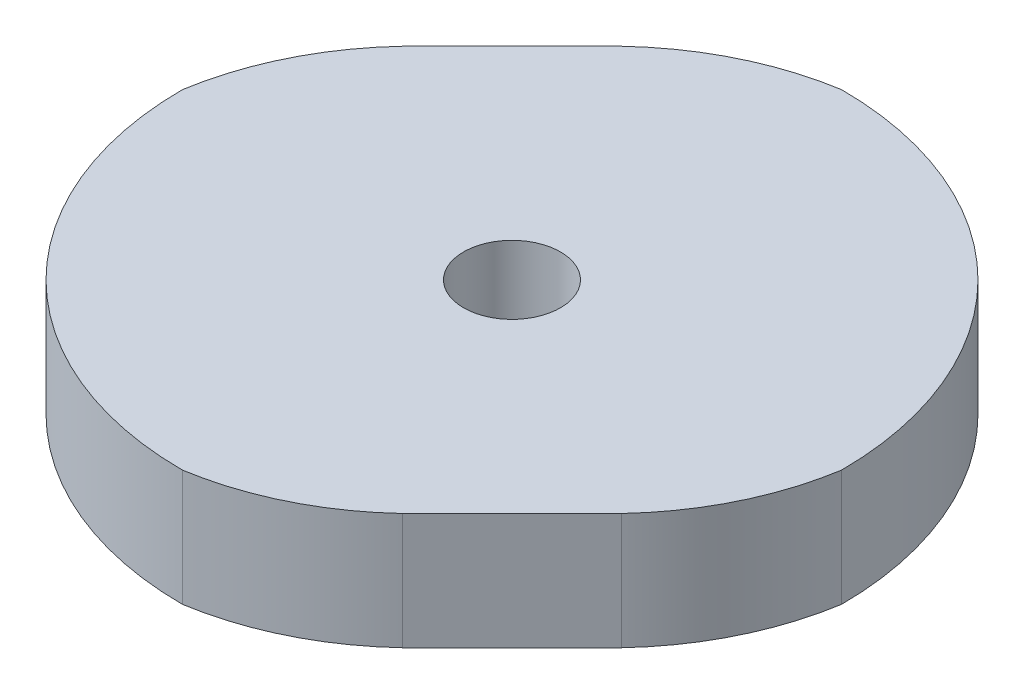
ISO-10303-21;
HEADER;
FILE_DESCRIPTION(('STEP AP214'),'2;1');
FILE_NAME('part.step','',(''),(''),'','','');
FILE_SCHEMA(('AUTOMOTIVE_DESIGN { 1 0 10303 214 1 1 1 1 }'));
ENDSEC;
DATA;
#1=APPLICATION_CONTEXT('core data for automotive mechanical design processes');
#2=APPLICATION_PROTOCOL_DEFINITION('international standard','automotive_design',2000,#1);
#3=PRODUCT_CONTEXT('',#1,'mechanical');
#4=PRODUCT('Part','Part','',(#3));
#5=PRODUCT_RELATED_PRODUCT_CATEGORY('part','',(#4));
#6=PRODUCT_DEFINITION_FORMATION('','',#4);
#7=PRODUCT_DEFINITION_CONTEXT('part definition',#1,'design');
#8=PRODUCT_DEFINITION('design','',#6,#7);
#9=PRODUCT_DEFINITION_SHAPE('','',#8);
#10=(LENGTH_UNIT() NAMED_UNIT(*) SI_UNIT(.MILLI.,.METRE.));
#11=(NAMED_UNIT(*) PLANE_ANGLE_UNIT() SI_UNIT($,.RADIAN.));
#12=(NAMED_UNIT(*) SI_UNIT($,.STERADIAN.) SOLID_ANGLE_UNIT());
#13=UNCERTAINTY_MEASURE_WITH_UNIT(LENGTH_MEASURE(1.E-05),#10,'distance_accuracy_value','');
#14=(GEOMETRIC_REPRESENTATION_CONTEXT(3) GLOBAL_UNCERTAINTY_ASSIGNED_CONTEXT((#13)) GLOBAL_UNIT_ASSIGNED_CONTEXT((#10,
#11,#12)) REPRESENTATION_CONTEXT('',''));
#15=CARTESIAN_POINT('',(0.,0.,0.));
#16=DIRECTION('',(0.,0.,1.));
#17=DIRECTION('',(1.,0.,0.));
#18=AXIS2_PLACEMENT_3D('',#15,#16,#17);
#19=CARTESIAN_POINT('',(-1.34728806771711,3.,1.14944795067981));
#20=DIRECTION('',(0.,-1.,0.));
#21=DIRECTION('',(0.,0.,-1.));
#22=AXIS2_PLACEMENT_3D('',#19,#20,#21);
#23=CYLINDRICAL_SURFACE('',#22,7.24448193990046);
#24=CARTESIAN_POINT('',(-1.34728806771711,0.,1.14944795067981));
#25=DIRECTION('',(0.,1.,0.));
#26=DIRECTION('',(0.,0.,1.));
#27=AXIS2_PLACEMENT_3D('',#24,#25,#26);
#28=CIRCLE('',#27,7.24448193990046);
#29=CARTESIAN_POINT('',(-8.49999999999999,0.,0.));
#30=VERTEX_POINT('',#29);
#31=CARTESIAN_POINT('',(-6.63227160484845,0.,-3.80549580175517));
#32=VERTEX_POINT('',#31);
#33=EDGE_CURVE('E148',#30,#32,#28,.F.);
#34=ORIENTED_EDGE('',*,*,#33,.F.);
#35=DIRECTION('',(0.,-1.,0.));
#36=VECTOR('',#35,1.);
#37=CARTESIAN_POINT('',(-8.49999999999999,3.,0.));
#38=LINE('',#37,#36);
#39=CARTESIAN_POINT('',(-8.49999999999999,3.,0.));
#40=VERTEX_POINT('',#39);
#41=EDGE_CURVE('E11',#40,#30,#38,.T.);
#42=ORIENTED_EDGE('',*,*,#41,.F.);
#43=CARTESIAN_POINT('',(-1.34728806771711,3.,1.14944795067981));
#44=DIRECTION('',(0.,1.,0.));
#45=DIRECTION('',(0.,0.,1.));
#46=AXIS2_PLACEMENT_3D('',#43,#44,#45);
#47=CIRCLE('',#46,7.24448193990046);
#48=CARTESIAN_POINT('',(-6.63227160484845,3.,-3.80549580175517));
#49=VERTEX_POINT('',#48);
#50=EDGE_CURVE('E206',#40,#49,#47,.F.);
#51=ORIENTED_EDGE('',*,*,#50,.T.);
#52=DIRECTION('',(0.,-1.,0.));
#53=VECTOR('',#52,1.);
#54=CARTESIAN_POINT('',(-6.63227160484845,3.,-3.80549580175517));
#55=LINE('',#54,#53);
#56=EDGE_CURVE('E83',#49,#32,#55,.T.);
#57=ORIENTED_EDGE('',*,*,#56,.T.);
#58=EDGE_LOOP('',(#34,#42,#51,#57));
#59=FACE_BOUND('',#58,.T.);
#60=ADVANCED_FACE('F32',(#59),#23,.T.);
#61=CARTESIAN_POINT('',(0.,3.,0.));
#62=DIRECTION('',(0.,-1.,0.));
#63=DIRECTION('',(0.,0.,-1.));
#64=AXIS2_PLACEMENT_3D('',#61,#62,#63);
#65=CYLINDRICAL_SURFACE('',#64,8.5);
#66=CARTESIAN_POINT('',(0.,0.,0.));
#67=DIRECTION('',(0.,1.,0.));
#68=DIRECTION('',(0.,0.,1.));
#69=AXIS2_PLACEMENT_3D('',#66,#67,#68);
#70=CIRCLE('',#69,8.5);
#71=CARTESIAN_POINT('',(0.,0.,8.5));
#72=VERTEX_POINT('',#71);
#73=EDGE_CURVE('E146',#30,#72,#70,.T.);
#74=ORIENTED_EDGE('',*,*,#73,.T.);
#75=DIRECTION('',(0.,-1.,0.));
#76=VECTOR('',#75,1.);
#77=CARTESIAN_POINT('',(0.,3.,8.5));
#78=LINE('',#77,#76);
#79=CARTESIAN_POINT('',(0.,3.,8.5));
#80=VERTEX_POINT('',#79);
#81=EDGE_CURVE('E41',#80,#72,#78,.T.);
#82=ORIENTED_EDGE('',*,*,#81,.F.);
#83=CARTESIAN_POINT('',(0.,3.,0.));
#84=DIRECTION('',(0.,1.,0.));
#85=DIRECTION('',(0.,0.,1.));
#86=AXIS2_PLACEMENT_3D('',#83,#84,#85);
#87=CIRCLE('',#86,8.5);
#88=EDGE_CURVE('E208',#40,#80,#87,.T.);
#89=ORIENTED_EDGE('',*,*,#88,.F.);
#90=ORIENTED_EDGE('',*,*,#41,.T.);
#91=EDGE_LOOP('',(#74,#82,#89,#90));
#92=FACE_BOUND('',#91,.T.);
#93=ADVANCED_FACE('F147',(#92),#65,.T.);
#94=CARTESIAN_POINT('',(-1.14944795067978,3.,1.34728806771712));
#95=DIRECTION('',(0.,-1.,0.));
#96=DIRECTION('',(0.,0.,-1.));
#97=AXIS2_PLACEMENT_3D('',#94,#95,#96);
#98=CYLINDRICAL_SURFACE('',#97,7.24448193990045);
#99=CARTESIAN_POINT('',(-1.14944795067978,0.,1.34728806771712));
#100=DIRECTION('',(0.,1.,0.));
#101=DIRECTION('',(0.,0.,1.));
#102=AXIS2_PLACEMENT_3D('',#99,#100,#101);
#103=CIRCLE('',#102,7.24448193990045);
#104=CARTESIAN_POINT('',(3.80549580175529,0.,6.63227160484838));
#105=VERTEX_POINT('',#104);
#106=EDGE_CURVE('E140',#72,#105,#103,.T.);
#107=ORIENTED_EDGE('',*,*,#106,.T.);
#108=DIRECTION('',(0.,-1.,0.));
#109=VECTOR('',#108,1.);
#110=CARTESIAN_POINT('',(3.80549580175529,3.,6.63227160484838));
#111=LINE('',#110,#109);
#112=CARTESIAN_POINT('',(3.80549580175529,3.,6.63227160484838));
#113=VERTEX_POINT('',#112);
#114=EDGE_CURVE('E132',#113,#105,#111,.T.);
#115=ORIENTED_EDGE('',*,*,#114,.F.);
#116=CARTESIAN_POINT('',(-1.14944795067978,3.,1.34728806771712));
#117=DIRECTION('',(0.,1.,0.));
#118=DIRECTION('',(0.,0.,1.));
#119=AXIS2_PLACEMENT_3D('',#116,#117,#118);
#120=CIRCLE('',#119,7.24448193990045);
#121=EDGE_CURVE('E142',#80,#113,#120,.T.);
#122=ORIENTED_EDGE('',*,*,#121,.F.);
#123=ORIENTED_EDGE('',*,*,#81,.T.);
#124=EDGE_LOOP('',(#107,#115,#122,#123));
#125=FACE_BOUND('',#124,.T.);
#126=ADVANCED_FACE('F138',(#125),#98,.T.);
#127=CARTESIAN_POINT('',(5.21888370330183,3.,5.21888370330185));
#128=DIRECTION('',(0.707106781186546,0.,0.707106781186548));
#129=DIRECTION('',(0.707106781186549,0.,-0.707106781186546));
#130=AXIS2_PLACEMENT_3D('',#127,#128,#129);
#131=PLANE('',#130);
#132=DIRECTION('',(-0.707106781186549,0.,0.707106781186546));
#133=VECTOR('',#132,1.);
#134=CARTESIAN_POINT('',(5.21888370330183,0.,5.21888370330185));
#135=LINE('',#134,#133);
#136=CARTESIAN_POINT('',(6.63227160484848,0.,3.8054958017552));
#137=VERTEX_POINT('',#136);
#138=EDGE_CURVE('E150',#137,#105,#135,.T.);
#139=ORIENTED_EDGE('',*,*,#138,.F.);
#140=DIRECTION('',(0.,-1.,0.));
#141=VECTOR('',#140,1.);
#142=CARTESIAN_POINT('',(6.63227160484848,3.,3.8054958017552));
#143=LINE('',#142,#141);
#144=CARTESIAN_POINT('',(6.63227160484848,3.,3.8054958017552));
#145=VERTEX_POINT('',#144);
#146=EDGE_CURVE('E126',#145,#137,#143,.T.);
#147=ORIENTED_EDGE('',*,*,#146,.F.);
#148=DIRECTION('',(-0.707106781186549,0.,0.707106781186546));
#149=VECTOR('',#148,1.);
#150=CARTESIAN_POINT('',(5.21888370330183,3.,5.21888370330185));
#151=LINE('',#150,#149);
#152=EDGE_CURVE('E213',#145,#113,#151,.T.);
#153=ORIENTED_EDGE('',*,*,#152,.T.);
#154=ORIENTED_EDGE('',*,*,#114,.T.);
#155=EDGE_LOOP('',(#139,#147,#153,#154));
#156=FACE_BOUND('',#155,.T.);
#157=ADVANCED_FACE('F189',(#156),#131,.T.);
#158=CARTESIAN_POINT('',(1.34728806771713,3.,-1.14944795067977));
#159=DIRECTION('',(0.,-1.,0.));
#160=DIRECTION('',(0.,0.,-1.));
#161=AXIS2_PLACEMENT_3D('',#158,#159,#160);
#162=CYLINDRICAL_SURFACE('',#161,7.24448193990044);
#163=CARTESIAN_POINT('',(1.34728806771713,0.,-1.14944795067977));
#164=DIRECTION('',(0.,1.,0.));
#165=DIRECTION('',(0.,0.,1.));
#166=AXIS2_PLACEMENT_3D('',#163,#164,#165);
#167=CIRCLE('',#166,7.24448193990044);
#168=CARTESIAN_POINT('',(8.5,0.,0.));
#169=VERTEX_POINT('',#168);
#170=EDGE_CURVE('E157',#169,#137,#167,.F.);
#171=ORIENTED_EDGE('',*,*,#170,.F.);
#172=DIRECTION('',(0.,-1.,0.));
#173=VECTOR('',#172,1.);
#174=CARTESIAN_POINT('',(8.5,3.,0.));
#175=LINE('',#174,#173);
#176=CARTESIAN_POINT('',(8.5,3.,0.));
#177=VERTEX_POINT('',#176);
#178=EDGE_CURVE('E124',#177,#169,#175,.T.);
#179=ORIENTED_EDGE('',*,*,#178,.F.);
#180=CARTESIAN_POINT('',(1.34728806771713,3.,-1.14944795067977));
#181=DIRECTION('',(0.,1.,0.));
#182=DIRECTION('',(0.,0.,1.));
#183=AXIS2_PLACEMENT_3D('',#180,#181,#182);
#184=CIRCLE('',#183,7.24448193990044);
#185=EDGE_CURVE('E118',#177,#145,#184,.F.);
#186=ORIENTED_EDGE('',*,*,#185,.T.);
#187=ORIENTED_EDGE('',*,*,#146,.T.);
#188=EDGE_LOOP('',(#171,#179,#186,#187));
#189=FACE_BOUND('',#188,.T.);
#190=ADVANCED_FACE('F192',(#189),#162,.T.);
#191=CARTESIAN_POINT('',(0.,3.,0.));
#192=DIRECTION('',(0.,-1.,0.));
#193=DIRECTION('',(0.,0.,-1.));
#194=AXIS2_PLACEMENT_3D('',#191,#192,#193);
#195=CYLINDRICAL_SURFACE('',#194,8.5);
#196=CARTESIAN_POINT('',(0.,0.,0.));
#197=DIRECTION('',(0.,1.,0.));
#198=DIRECTION('',(0.,0.,1.));
#199=AXIS2_PLACEMENT_3D('',#196,#197,#198);
#200=CIRCLE('',#199,8.5);
#201=CARTESIAN_POINT('',(0.,0.,-8.5));
#202=VERTEX_POINT('',#201);
#203=EDGE_CURVE('E123',#169,#202,#200,.T.);
#204=ORIENTED_EDGE('',*,*,#203,.T.);
#205=DIRECTION('',(0.,-1.,0.));
#206=VECTOR('',#205,1.);
#207=CARTESIAN_POINT('',(0.,3.,-8.5));
#208=LINE('',#207,#206);
#209=CARTESIAN_POINT('',(0.,3.,-8.5));
#210=VERTEX_POINT('',#209);
#211=EDGE_CURVE('E108',#210,#202,#208,.T.);
#212=ORIENTED_EDGE('',*,*,#211,.F.);
#213=CARTESIAN_POINT('',(0.,3.,0.));
#214=DIRECTION('',(0.,1.,0.));
#215=DIRECTION('',(0.,0.,1.));
#216=AXIS2_PLACEMENT_3D('',#213,#214,#215);
#217=CIRCLE('',#216,8.5);
#218=EDGE_CURVE('E111',#177,#210,#217,.T.);
#219=ORIENTED_EDGE('',*,*,#218,.F.);
#220=ORIENTED_EDGE('',*,*,#178,.T.);
#221=EDGE_LOOP('',(#204,#212,#219,#220));
#222=FACE_BOUND('',#221,.T.);
#223=ADVANCED_FACE('F121',(#222),#195,.T.);
#224=CARTESIAN_POINT('',(1.14944795067975,3.,-1.34728806771715));
#225=DIRECTION('',(0.,-1.,0.));
#226=DIRECTION('',(0.,0.,-1.));
#227=AXIS2_PLACEMENT_3D('',#224,#225,#226);
#228=CYLINDRICAL_SURFACE('',#227,7.24448193990042);
#229=CARTESIAN_POINT('',(1.14944795067975,0.,-1.34728806771715));
#230=DIRECTION('',(0.,1.,0.));
#231=DIRECTION('',(0.,0.,1.));
#232=AXIS2_PLACEMENT_3D('',#229,#230,#231);
#233=CIRCLE('',#232,7.24448193990042);
#234=CARTESIAN_POINT('',(-3.80549580175521,0.,-6.63227160484848));
#235=VERTEX_POINT('',#234);
#236=EDGE_CURVE('E161',#202,#235,#233,.T.);
#237=ORIENTED_EDGE('',*,*,#236,.T.);
#238=DIRECTION('',(0.,-1.,0.));
#239=VECTOR('',#238,1.);
#240=CARTESIAN_POINT('',(-3.80549580175521,3.,-6.63227160484848));
#241=LINE('',#240,#239);
#242=CARTESIAN_POINT('',(-3.80549580175521,3.,-6.63227160484848));
#243=VERTEX_POINT('',#242);
#244=EDGE_CURVE('E110',#243,#235,#241,.T.);
#245=ORIENTED_EDGE('',*,*,#244,.F.);
#246=CARTESIAN_POINT('',(1.14944795067975,3.,-1.34728806771715));
#247=DIRECTION('',(0.,1.,0.));
#248=DIRECTION('',(0.,0.,1.));
#249=AXIS2_PLACEMENT_3D('',#246,#247,#248);
#250=CIRCLE('',#249,7.24448193990042);
#251=EDGE_CURVE('E103',#210,#243,#250,.T.);
#252=ORIENTED_EDGE('',*,*,#251,.F.);
#253=ORIENTED_EDGE('',*,*,#211,.T.);
#254=EDGE_LOOP('',(#237,#245,#252,#253));
#255=FACE_BOUND('',#254,.T.);
#256=ADVANCED_FACE('F106',(#255),#228,.T.);
#257=CARTESIAN_POINT('',(0.,3.,0.));
#258=DIRECTION('',(0.,-1.,0.));
#259=DIRECTION('',(0.,0.,-1.));
#260=AXIS2_PLACEMENT_3D('',#257,#258,#259);
#261=CYLINDRICAL_SURFACE('',#260,1.25);
#262=CARTESIAN_POINT('',(0.,3.,0.));
#263=DIRECTION('',(0.,1.,0.));
#264=DIRECTION('',(0.,0.,1.));
#265=AXIS2_PLACEMENT_3D('',#262,#263,#264);
#266=CIRCLE('',#265,1.25);
#267=CARTESIAN_POINT('',(0.,3.,1.25));
#268=VERTEX_POINT('',#267);
#269=EDGE_CURVE('E163',#268,#268,#266,.T.);
#270=ORIENTED_EDGE('',*,*,#269,.T.);
#271=EDGE_LOOP('',(#270));
#272=FACE_BOUND('',#271,.T.);
#273=CARTESIAN_POINT('',(0.,0.,0.));
#274=DIRECTION('',(0.,1.,0.));
#275=DIRECTION('',(0.,0.,1.));
#276=AXIS2_PLACEMENT_3D('',#273,#274,#275);
#277=CIRCLE('',#276,1.25);
#278=CARTESIAN_POINT('',(0.,0.,1.25));
#279=VERTEX_POINT('',#278);
#280=EDGE_CURVE('E152',#279,#279,#277,.T.);
#281=ORIENTED_EDGE('',*,*,#280,.F.);
#282=EDGE_LOOP('',(#281));
#283=FACE_BOUND('',#282,.T.);
#284=ADVANCED_FACE('F34',(#272,#283),#261,.F.);
#285=CARTESIAN_POINT('',(-5.21888370330189,3.,-5.21888370330177));
#286=DIRECTION('',(0.707106781186555,0.,0.70710678118654));
#287=DIRECTION('',(0.70710678118654,0.,-0.707106781186555));
#288=AXIS2_PLACEMENT_3D('',#285,#286,#287);
#289=PLANE('',#288);
#290=DIRECTION('',(-0.70710678118654,0.,0.707106781186555));
#291=VECTOR('',#290,1.);
#292=CARTESIAN_POINT('',(-5.21888370330189,0.,-5.21888370330177));
#293=LINE('',#292,#291);
#294=EDGE_CURVE('E76',#235,#32,#293,.T.);
#295=ORIENTED_EDGE('',*,*,#294,.T.);
#296=ORIENTED_EDGE('',*,*,#56,.F.);
#297=DIRECTION('',(-0.70710678118654,0.,0.707106781186555));
#298=VECTOR('',#297,1.);
#299=CARTESIAN_POINT('',(-5.21888370330189,3.,-5.21888370330177));
#300=LINE('',#299,#298);
#301=EDGE_CURVE('E49',#243,#49,#300,.T.);
#302=ORIENTED_EDGE('',*,*,#301,.F.);
#303=ORIENTED_EDGE('',*,*,#244,.T.);
#304=EDGE_LOOP('',(#295,#296,#302,#303));
#305=FACE_BOUND('',#304,.T.);
#306=ADVANCED_FACE('F171',(#305),#289,.F.);
#307=CARTESIAN_POINT('',(0.,3.,0.));
#308=DIRECTION('',(0.,1.,0.));
#309=DIRECTION('',(0.,0.,1.));
#310=AXIS2_PLACEMENT_3D('',#307,#308,#309);
#311=PLANE('',#310);
#312=ORIENTED_EDGE('',*,*,#269,.F.);
#313=EDGE_LOOP('',(#312));
#314=FACE_BOUND('',#313,.T.);
#315=ORIENTED_EDGE('',*,*,#50,.F.);
#316=ORIENTED_EDGE('',*,*,#88,.T.);
#317=ORIENTED_EDGE('',*,*,#121,.T.);
#318=ORIENTED_EDGE('',*,*,#152,.F.);
#319=ORIENTED_EDGE('',*,*,#185,.F.);
#320=ORIENTED_EDGE('',*,*,#218,.T.);
#321=ORIENTED_EDGE('',*,*,#251,.T.);
#322=ORIENTED_EDGE('',*,*,#301,.T.);
#323=EDGE_LOOP('',(#315,#316,#317,#318,#319,#320,#321,#322));
#324=FACE_BOUND('',#323,.T.);
#325=ADVANCED_FACE('F115',(#314,#324),#311,.T.);
#326=CARTESIAN_POINT('',(0.,0.,0.));
#327=DIRECTION('',(0.,1.,0.));
#328=DIRECTION('',(0.,0.,1.));
#329=AXIS2_PLACEMENT_3D('',#326,#327,#328);
#330=PLANE('',#329);
#331=ORIENTED_EDGE('',*,*,#280,.T.);
#332=EDGE_LOOP('',(#331));
#333=FACE_BOUND('',#332,.T.);
#334=ORIENTED_EDGE('',*,*,#33,.T.);
#335=ORIENTED_EDGE('',*,*,#294,.F.);
#336=ORIENTED_EDGE('',*,*,#236,.F.);
#337=ORIENTED_EDGE('',*,*,#203,.F.);
#338=ORIENTED_EDGE('',*,*,#170,.T.);
#339=ORIENTED_EDGE('',*,*,#138,.T.);
#340=ORIENTED_EDGE('',*,*,#106,.F.);
#341=ORIENTED_EDGE('',*,*,#73,.F.);
#342=EDGE_LOOP('',(#334,#335,#336,#337,#338,#339,#340,#341));
#343=FACE_BOUND('',#342,.T.);
#344=ADVANCED_FACE('F168',(#333,#343),#330,.F.);
#345=CLOSED_SHELL('',(#60,#93,#126,#157,#190,#223,#256,#284,#306,#325,#344));
#346=MANIFOLD_SOLID_BREP('B2',#345);
#347=ADVANCED_BREP_SHAPE_REPRESENTATION('',(#18,#346),#14);
#348=SHAPE_DEFINITION_REPRESENTATION(#9,#347);
ENDSEC;
END-ISO-10303-21;
